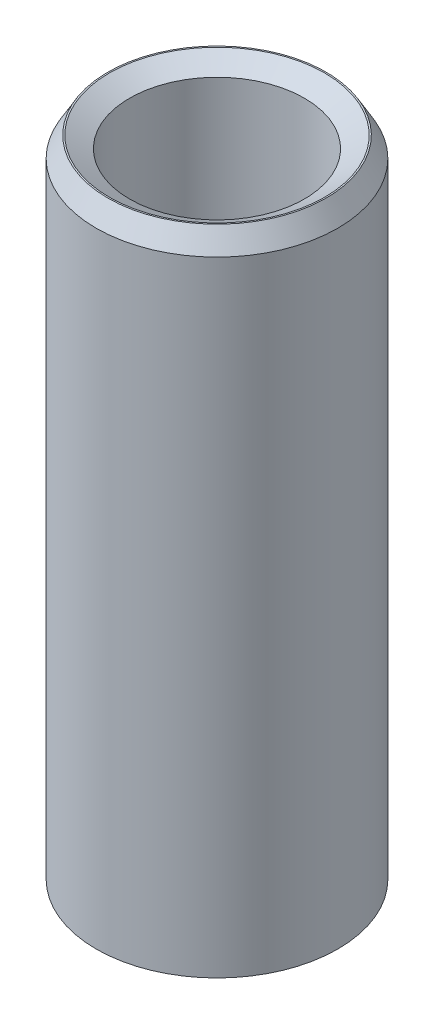
ISO-10303-21;
HEADER;
FILE_DESCRIPTION(('STEP AP214'),'2;1');
FILE_NAME('part.step','',(''),(''),'','','');
FILE_SCHEMA(('AUTOMOTIVE_DESIGN { 1 0 10303 214 1 1 1 1 }'));
ENDSEC;
DATA;
#1=APPLICATION_CONTEXT('core data for automotive mechanical design processes');
#2=APPLICATION_PROTOCOL_DEFINITION('international standard','automotive_design',2000,#1);
#3=PRODUCT_CONTEXT('',#1,'mechanical');
#4=PRODUCT('Part','Part','',(#3));
#5=PRODUCT_RELATED_PRODUCT_CATEGORY('part','',(#4));
#6=PRODUCT_DEFINITION_FORMATION('','',#4);
#7=PRODUCT_DEFINITION_CONTEXT('part definition',#1,'design');
#8=PRODUCT_DEFINITION('design','',#6,#7);
#9=PRODUCT_DEFINITION_SHAPE('','',#8);
#10=(LENGTH_UNIT() NAMED_UNIT(*) SI_UNIT(.MILLI.,.METRE.));
#11=(NAMED_UNIT(*) PLANE_ANGLE_UNIT() SI_UNIT($,.RADIAN.));
#12=(NAMED_UNIT(*) SI_UNIT($,.STERADIAN.) SOLID_ANGLE_UNIT());
#13=UNCERTAINTY_MEASURE_WITH_UNIT(LENGTH_MEASURE(1.E-05),#10,'distance_accuracy_value','');
#14=(GEOMETRIC_REPRESENTATION_CONTEXT(3) GLOBAL_UNCERTAINTY_ASSIGNED_CONTEXT((#13)) GLOBAL_UNIT_ASSIGNED_CONTEXT((#10,
#11,#12)) REPRESENTATION_CONTEXT('',''));
#15=CARTESIAN_POINT('',(0.,0.,0.));
#16=DIRECTION('',(0.,0.,1.));
#17=DIRECTION('',(1.,0.,0.));
#18=AXIS2_PLACEMENT_3D('',#15,#16,#17);
#19=CARTESIAN_POINT('',(0.,67.8888156274553,0.));
#20=DIRECTION('',(0.,-1.,0.));
#21=DIRECTION('',(0.,0.,-1.));
#22=AXIS2_PLACEMENT_3D('',#19,#20,#21);
#23=CYLINDRICAL_SURFACE('',#22,12.5);
#24=CARTESIAN_POINT('',(0.,1.20893583573321,0.));
#25=DIRECTION('',(0.,1.,0.));
#26=DIRECTION('',(0.,0.,1.));
#27=AXIS2_PLACEMENT_3D('',#24,#25,#26);
#28=CIRCLE('',#27,12.5);
#29=CARTESIAN_POINT('',(0.,1.20893583573321,12.5));
#30=VERTEX_POINT('',#29);
#31=EDGE_CURVE('E10',#30,#30,#28,.T.);
#32=ORIENTED_EDGE('',*,*,#31,.T.);
#33=EDGE_LOOP('',(#32));
#34=FACE_BOUND('',#33,.T.);
#35=CARTESIAN_POINT('',(0.,65.7948773368746,0.));
#36=DIRECTION('',(0.,1.,0.));
#37=DIRECTION('',(0.,0.,1.));
#38=AXIS2_PLACEMENT_3D('',#35,#36,#37);
#39=CIRCLE('',#38,12.5);
#40=CARTESIAN_POINT('',(0.,65.7948773368746,12.5));
#41=VERTEX_POINT('',#40);
#42=EDGE_CURVE('E50',#41,#41,#39,.F.);
#43=ORIENTED_EDGE('',*,*,#42,.T.);
#44=EDGE_LOOP('',(#43));
#45=FACE_BOUND('',#44,.T.);
#46=ADVANCED_FACE('F39',(#34,#45),#23,.T.);
#47=CARTESIAN_POINT('',(0.,67.8888156274553,0.));
#48=DIRECTION('',(0.,1.,0.));
#49=DIRECTION('',(0.,0.,1.));
#50=AXIS2_PLACEMENT_3D('',#47,#48,#49);
#51=PLANE('',#50);
#52=CARTESIAN_POINT('',(0.,67.8888156274553,0.));
#53=DIRECTION('',(0.,1.,0.));
#54=DIRECTION('',(0.,0.,1.));
#55=AXIS2_PLACEMENT_3D('',#52,#53,#54);
#56=CIRCLE('',#55,11.1376015192412);
#57=CARTESIAN_POINT('',(0.,67.8888156274553,11.1376015192412));
#58=VERTEX_POINT('',#57);
#59=EDGE_CURVE('E58',#58,#58,#56,.F.);
#60=ORIENTED_EDGE('',*,*,#59,.T.);
#61=EDGE_LOOP('',(#60));
#62=FACE_BOUND('',#61,.T.);
#63=CARTESIAN_POINT('',(0.,67.8888156274553,0.));
#64=DIRECTION('',(0.,1.,0.));
#65=DIRECTION('',(0.,0.,1.));
#66=AXIS2_PLACEMENT_3D('',#63,#64,#65);
#67=CIRCLE('',#66,11.2910641642668);
#68=CARTESIAN_POINT('',(0.,67.8888156274553,11.2910641642668));
#69=VERTEX_POINT('',#68);
#70=EDGE_CURVE('E61',#69,#69,#67,.T.);
#71=ORIENTED_EDGE('',*,*,#70,.T.);
#72=EDGE_LOOP('',(#71));
#73=FACE_BOUND('',#72,.T.);
#74=ADVANCED_FACE('F88',(#62,#73),#51,.T.);
#75=CARTESIAN_POINT('',(0.,0.,0.));
#76=DIRECTION('',(0.,1.,0.));
#77=DIRECTION('',(0.,0.,1.));
#78=AXIS2_PLACEMENT_3D('',#75,#76,#77);
#79=PLANE('',#78);
#80=CARTESIAN_POINT('',(0.,0.,0.));
#81=DIRECTION('',(0.,1.,0.));
#82=DIRECTION('',(0.,0.,1.));
#83=AXIS2_PLACEMENT_3D('',#80,#81,#82);
#84=CIRCLE('',#83,10.2525990643937);
#85=CARTESIAN_POINT('',(0.,0.,10.2525990643937));
#86=VERTEX_POINT('',#85);
#87=EDGE_CURVE('E51',#86,#86,#84,.T.);
#88=ORIENTED_EDGE('',*,*,#87,.T.);
#89=EDGE_LOOP('',(#88));
#90=FACE_BOUND('',#89,.T.);
#91=CARTESIAN_POINT('',(0.,0.,0.));
#92=DIRECTION('',(0.,1.,0.));
#93=DIRECTION('',(0.,0.,1.));
#94=AXIS2_PLACEMENT_3D('',#91,#92,#93);
#95=CIRCLE('',#94,10.4060617094193);
#96=CARTESIAN_POINT('',(0.,0.,10.4060617094193));
#97=VERTEX_POINT('',#96);
#98=EDGE_CURVE('E54',#97,#97,#95,.F.);
#99=ORIENTED_EDGE('',*,*,#98,.T.);
#100=EDGE_LOOP('',(#99));
#101=FACE_BOUND('',#100,.T.);
#102=ADVANCED_FACE('F83',(#90,#101),#79,.F.);
#103=CARTESIAN_POINT('',(0.,67.8888156274553,0.));
#104=DIRECTION('',(0.,-1.,0.));
#105=DIRECTION('',(0.,0.,-1.));
#106=AXIS2_PLACEMENT_3D('',#103,#104,#105);
#107=CYLINDRICAL_SURFACE('',#106,9.04366322866048);
#108=CARTESIAN_POINT('',(0.,66.6798797917221,0.));
#109=DIRECTION('',(0.,1.,0.));
#110=DIRECTION('',(0.,0.,1.));
#111=AXIS2_PLACEMENT_3D('',#108,#109,#110);
#112=CIRCLE('',#111,9.04366322866048);
#113=CARTESIAN_POINT('',(0.,66.6798797917221,9.04366322866048));
#114=VERTEX_POINT('',#113);
#115=EDGE_CURVE('E67',#114,#114,#112,.T.);
#116=ORIENTED_EDGE('',*,*,#115,.T.);
#117=EDGE_LOOP('',(#116));
#118=FACE_BOUND('',#117,.T.);
#119=CARTESIAN_POINT('',(0.,2.09393829058066,0.));
#120=DIRECTION('',(0.,1.,0.));
#121=DIRECTION('',(0.,0.,1.));
#122=AXIS2_PLACEMENT_3D('',#119,#120,#121);
#123=CIRCLE('',#122,9.04366322866048);
#124=CARTESIAN_POINT('',(0.,2.09393829058066,9.04366322866048));
#125=VERTEX_POINT('',#124);
#126=EDGE_CURVE('E69',#125,#125,#123,.F.);
#127=ORIENTED_EDGE('',*,*,#126,.T.);
#128=EDGE_LOOP('',(#127));
#129=FACE_BOUND('',#128,.T.);
#130=ADVANCED_FACE('F71',(#118,#129),#107,.F.);
#131=CARTESIAN_POINT('',(0.,66.6798797917221,0.));
#132=DIRECTION('',(0.,1.,0.));
#133=DIRECTION('',(0.,0.,1.));
#134=AXIS2_PLACEMENT_3D('',#131,#132,#133);
#135=CONICAL_SURFACE('',#134,9.04366322866048,1.0471975511966);
#136=ORIENTED_EDGE('',*,*,#59,.F.);
#137=EDGE_LOOP('',(#136));
#138=FACE_BOUND('',#137,.T.);
#139=ORIENTED_EDGE('',*,*,#115,.F.);
#140=EDGE_LOOP('',(#139));
#141=FACE_BOUND('',#140,.T.);
#142=ADVANCED_FACE('F77',(#138,#141),#135,.F.);
#143=CARTESIAN_POINT('',(0.,0.,0.));
#144=DIRECTION('',(0.,-1.,0.));
#145=DIRECTION('',(0.,0.,-1.));
#146=AXIS2_PLACEMENT_3D('',#143,#144,#145);
#147=CONICAL_SURFACE('',#146,10.2525990643937,0.5235987755983);
#148=ORIENTED_EDGE('',*,*,#126,.F.);
#149=EDGE_LOOP('',(#148));
#150=FACE_BOUND('',#149,.T.);
#151=ORIENTED_EDGE('',*,*,#87,.F.);
#152=EDGE_LOOP('',(#151));
#153=FACE_BOUND('',#152,.T.);
#154=ADVANCED_FACE('F73',(#150,#153),#147,.F.);
#155=CARTESIAN_POINT('',(0.,1.20893583573321,0.));
#156=DIRECTION('',(0.,1.,0.));
#157=DIRECTION('',(0.,0.,1.));
#158=AXIS2_PLACEMENT_3D('',#155,#156,#157);
#159=CONICAL_SURFACE('',#158,12.5,1.0471975511966);
#160=ORIENTED_EDGE('',*,*,#98,.F.);
#161=EDGE_LOOP('',(#160));
#162=FACE_BOUND('',#161,.T.);
#163=ORIENTED_EDGE('',*,*,#31,.F.);
#164=EDGE_LOOP('',(#163));
#165=FACE_BOUND('',#164,.T.);
#166=ADVANCED_FACE('F76',(#162,#165),#159,.T.);
#167=CARTESIAN_POINT('',(0.,67.8888156274553,0.));
#168=DIRECTION('',(0.,-1.,0.));
#169=DIRECTION('',(0.,0.,-1.));
#170=AXIS2_PLACEMENT_3D('',#167,#168,#169);
#171=CONICAL_SURFACE('',#170,11.2910641642668,0.523598775598296);
#172=ORIENTED_EDGE('',*,*,#42,.F.);
#173=EDGE_LOOP('',(#172));
#174=FACE_BOUND('',#173,.T.);
#175=ORIENTED_EDGE('',*,*,#70,.F.);
#176=EDGE_LOOP('',(#175));
#177=FACE_BOUND('',#176,.T.);
#178=ADVANCED_FACE('F45',(#174,#177),#171,.T.);
#179=CLOSED_SHELL('',(#46,#74,#102,#130,#142,#154,#166,#178));
#180=MANIFOLD_SOLID_BREP('B2',#179);
#181=ADVANCED_BREP_SHAPE_REPRESENTATION('',(#18,#180),#14);
#182=SHAPE_DEFINITION_REPRESENTATION(#9,#181);
ENDSEC;
END-ISO-10303-21;
